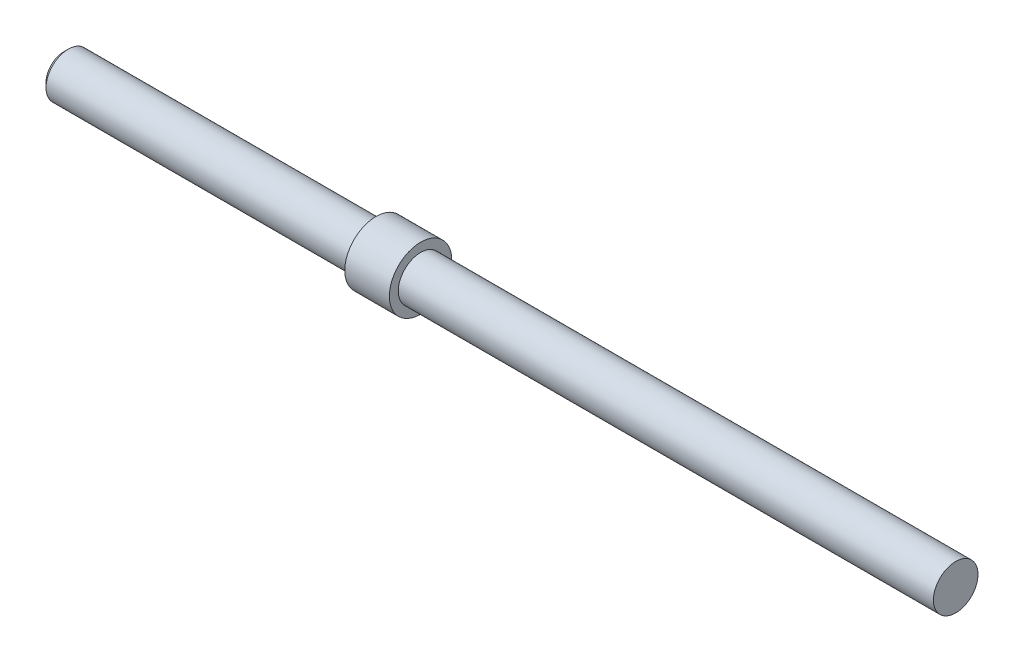
ISO-10303-21;
HEADER;
FILE_DESCRIPTION(('STEP AP214'),'2;1');
FILE_NAME('part.step','',(''),(''),'','','');
FILE_SCHEMA(('AUTOMOTIVE_DESIGN { 1 0 10303 214 1 1 1 1 }'));
ENDSEC;
DATA;
#1=APPLICATION_CONTEXT('core data for automotive mechanical design processes');
#2=APPLICATION_PROTOCOL_DEFINITION('international standard','automotive_design',2000,#1);
#3=PRODUCT_CONTEXT('',#1,'mechanical');
#4=PRODUCT('Part','Part','',(#3));
#5=PRODUCT_RELATED_PRODUCT_CATEGORY('part','',(#4));
#6=PRODUCT_DEFINITION_FORMATION('','',#4);
#7=PRODUCT_DEFINITION_CONTEXT('part definition',#1,'design');
#8=PRODUCT_DEFINITION('design','',#6,#7);
#9=PRODUCT_DEFINITION_SHAPE('','',#8);
#10=(LENGTH_UNIT() NAMED_UNIT(*) SI_UNIT(.MILLI.,.METRE.));
#11=(NAMED_UNIT(*) PLANE_ANGLE_UNIT() SI_UNIT($,.RADIAN.));
#12=(NAMED_UNIT(*) SI_UNIT($,.STERADIAN.) SOLID_ANGLE_UNIT());
#13=UNCERTAINTY_MEASURE_WITH_UNIT(LENGTH_MEASURE(1.E-05),#10,'distance_accuracy_value','');
#14=(GEOMETRIC_REPRESENTATION_CONTEXT(3) GLOBAL_UNCERTAINTY_ASSIGNED_CONTEXT((#13)) GLOBAL_UNIT_ASSIGNED_CONTEXT((#10,
#11,#12)) REPRESENTATION_CONTEXT('',''));
#15=CARTESIAN_POINT('',(0.,0.,0.));
#16=DIRECTION('',(0.,0.,1.));
#17=DIRECTION('',(1.,0.,0.));
#18=AXIS2_PLACEMENT_3D('',#15,#16,#17);
#19=CARTESIAN_POINT('',(200.,0.,0.));
#20=DIRECTION('',(-1.,0.,0.));
#21=DIRECTION('',(0.,0.,1.));
#22=AXIS2_PLACEMENT_3D('',#19,#20,#21);
#23=CYLINDRICAL_SURFACE('',#22,5.);
#24=CARTESIAN_POINT('',(0.999999999999945,0.,0.));
#25=DIRECTION('',(1.,0.,0.));
#26=DIRECTION('',(0.,0.,-1.));
#27=AXIS2_PLACEMENT_3D('',#24,#25,#26);
#28=CIRCLE('',#27,5.);
#29=CARTESIAN_POINT('',(0.999999999999945,0.,-5.));
#30=VERTEX_POINT('',#29);
#31=EDGE_CURVE('E43',#30,#30,#28,.T.);
#32=ORIENTED_EDGE('',*,*,#31,.T.);
#33=EDGE_LOOP('',(#32));
#34=FACE_BOUND('',#33,.T.);
#35=CARTESIAN_POINT('',(70.,0.,0.));
#36=DIRECTION('',(1.,0.,0.));
#37=DIRECTION('',(0.,0.,-1.));
#38=AXIS2_PLACEMENT_3D('',#35,#36,#37);
#39=CIRCLE('',#38,5.);
#40=CARTESIAN_POINT('',(70.,0.,-5.));
#41=VERTEX_POINT('',#40);
#42=EDGE_CURVE('E10',#41,#41,#39,.T.);
#43=ORIENTED_EDGE('',*,*,#42,.F.);
#44=EDGE_LOOP('',(#43));
#45=FACE_BOUND('',#44,.T.);
#46=ADVANCED_FACE('F31',(#34,#45),#23,.T.);
#47=CARTESIAN_POINT('',(0.,0.,0.));
#48=DIRECTION('',(1.,0.,0.));
#49=DIRECTION('',(0.,0.,-1.));
#50=AXIS2_PLACEMENT_3D('',#47,#48,#49);
#51=PLANE('',#50);
#52=CARTESIAN_POINT('',(0.,0.,0.));
#53=DIRECTION('',(1.,0.,0.));
#54=DIRECTION('',(0.,0.,-1.));
#55=AXIS2_PLACEMENT_3D('',#52,#53,#54);
#56=CIRCLE('',#55,4.00000000000003);
#57=CARTESIAN_POINT('',(0.,0.,-4.00000000000003));
#58=VERTEX_POINT('',#57);
#59=EDGE_CURVE('E39',#58,#58,#56,.F.);
#60=ORIENTED_EDGE('',*,*,#59,.T.);
#61=EDGE_LOOP('',(#60));
#62=FACE_BOUND('',#61,.T.);
#63=ADVANCED_FACE('F78',(#62),#51,.F.);
#64=CARTESIAN_POINT('',(0.999999999999945,0.,0.));
#65=DIRECTION('',(1.,0.,0.));
#66=DIRECTION('',(0.,0.,-1.));
#67=AXIS2_PLACEMENT_3D('',#64,#65,#66);
#68=CONICAL_SURFACE('',#67,5.,0.78539816339746);
#69=ORIENTED_EDGE('',*,*,#59,.F.);
#70=EDGE_LOOP('',(#69));
#71=FACE_BOUND('',#70,.T.);
#72=ORIENTED_EDGE('',*,*,#31,.F.);
#73=EDGE_LOOP('',(#72));
#74=FACE_BOUND('',#73,.T.);
#75=ADVANCED_FACE('F33',(#71,#74),#68,.T.);
#76=CARTESIAN_POINT('',(80.,0.,0.));
#77=DIRECTION('',(-1.,0.,0.));
#78=DIRECTION('',(0.,0.,1.));
#79=AXIS2_PLACEMENT_3D('',#76,#77,#78);
#80=CYLINDRICAL_SURFACE('',#79,7.);
#81=CARTESIAN_POINT('',(80.,0.,0.));
#82=DIRECTION('',(1.,0.,0.));
#83=DIRECTION('',(0.,0.,-1.));
#84=AXIS2_PLACEMENT_3D('',#81,#82,#83);
#85=CIRCLE('',#84,7.);
#86=CARTESIAN_POINT('',(80.,0.,-7.));
#87=VERTEX_POINT('',#86);
#88=EDGE_CURVE('E54',#87,#87,#85,.T.);
#89=ORIENTED_EDGE('',*,*,#88,.F.);
#90=EDGE_LOOP('',(#89));
#91=FACE_BOUND('',#90,.T.);
#92=CARTESIAN_POINT('',(70.,0.,0.));
#93=DIRECTION('',(1.,0.,0.));
#94=DIRECTION('',(0.,0.,-1.));
#95=AXIS2_PLACEMENT_3D('',#92,#93,#94);
#96=CIRCLE('',#95,7.);
#97=CARTESIAN_POINT('',(70.,0.,-7.));
#98=VERTEX_POINT('',#97);
#99=EDGE_CURVE('E51',#98,#98,#96,.T.);
#100=ORIENTED_EDGE('',*,*,#99,.T.);
#101=EDGE_LOOP('',(#100));
#102=FACE_BOUND('',#101,.T.);
#103=ADVANCED_FACE('F67',(#91,#102),#80,.T.);
#104=CARTESIAN_POINT('',(80.,0.,0.));
#105=DIRECTION('',(1.,0.,0.));
#106=DIRECTION('',(0.,0.,-1.));
#107=AXIS2_PLACEMENT_3D('',#104,#105,#106);
#108=PLANE('',#107);
#109=CARTESIAN_POINT('',(80.,0.,0.));
#110=DIRECTION('',(1.,0.,0.));
#111=DIRECTION('',(0.,0.,-1.));
#112=AXIS2_PLACEMENT_3D('',#109,#110,#111);
#113=CIRCLE('',#112,5.);
#114=CARTESIAN_POINT('',(80.,0.,-5.));
#115=VERTEX_POINT('',#114);
#116=EDGE_CURVE('E35',#115,#115,#113,.T.);
#117=ORIENTED_EDGE('',*,*,#116,.F.);
#118=EDGE_LOOP('',(#117));
#119=FACE_BOUND('',#118,.T.);
#120=ORIENTED_EDGE('',*,*,#88,.T.);
#121=EDGE_LOOP('',(#120));
#122=FACE_BOUND('',#121,.T.);
#123=ADVANCED_FACE('F64',(#119,#122),#108,.T.);
#124=CARTESIAN_POINT('',(70.,0.,0.));
#125=DIRECTION('',(1.,0.,0.));
#126=DIRECTION('',(0.,0.,-1.));
#127=AXIS2_PLACEMENT_3D('',#124,#125,#126);
#128=PLANE('',#127);
#129=ORIENTED_EDGE('',*,*,#42,.T.);
#130=EDGE_LOOP('',(#129));
#131=FACE_BOUND('',#130,.T.);
#132=ORIENTED_EDGE('',*,*,#99,.F.);
#133=EDGE_LOOP('',(#132));
#134=FACE_BOUND('',#133,.T.);
#135=ADVANCED_FACE('F66',(#131,#134),#128,.F.);
#136=CARTESIAN_POINT('',(200.,0.,0.));
#137=DIRECTION('',(1.,0.,0.));
#138=DIRECTION('',(0.,0.,-1.));
#139=AXIS2_PLACEMENT_3D('',#136,#137,#138);
#140=PLANE('',#139);
#141=CARTESIAN_POINT('',(200.,0.,0.));
#142=DIRECTION('',(1.,0.,0.));
#143=DIRECTION('',(0.,0.,-1.));
#144=AXIS2_PLACEMENT_3D('',#141,#142,#143);
#145=CIRCLE('',#144,5.);
#146=CARTESIAN_POINT('',(200.,0.,-5.));
#147=VERTEX_POINT('',#146);
#148=EDGE_CURVE('E48',#147,#147,#145,.T.);
#149=ORIENTED_EDGE('',*,*,#148,.T.);
#150=EDGE_LOOP('',(#149));
#151=FACE_BOUND('',#150,.T.);
#152=ADVANCED_FACE('F73',(#151),#140,.T.);
#153=ORIENTED_EDGE('',*,*,#116,.T.);
#154=EDGE_LOOP('',(#153));
#155=FACE_BOUND('',#154,.T.);
#156=ORIENTED_EDGE('',*,*,#148,.F.);
#157=EDGE_LOOP('',(#156));
#158=FACE_BOUND('',#157,.T.);
#159=ADVANCED_FACE('F61',(#155,#158),#23,.T.);
#160=CLOSED_SHELL('',(#46,#63,#75,#103,#123,#135,#152,#159));
#161=MANIFOLD_SOLID_BREP('B2',#160);
#162=ADVANCED_BREP_SHAPE_REPRESENTATION('',(#18,#161),#14);
#163=SHAPE_DEFINITION_REPRESENTATION(#9,#162);
ENDSEC;
END-ISO-10303-21;
